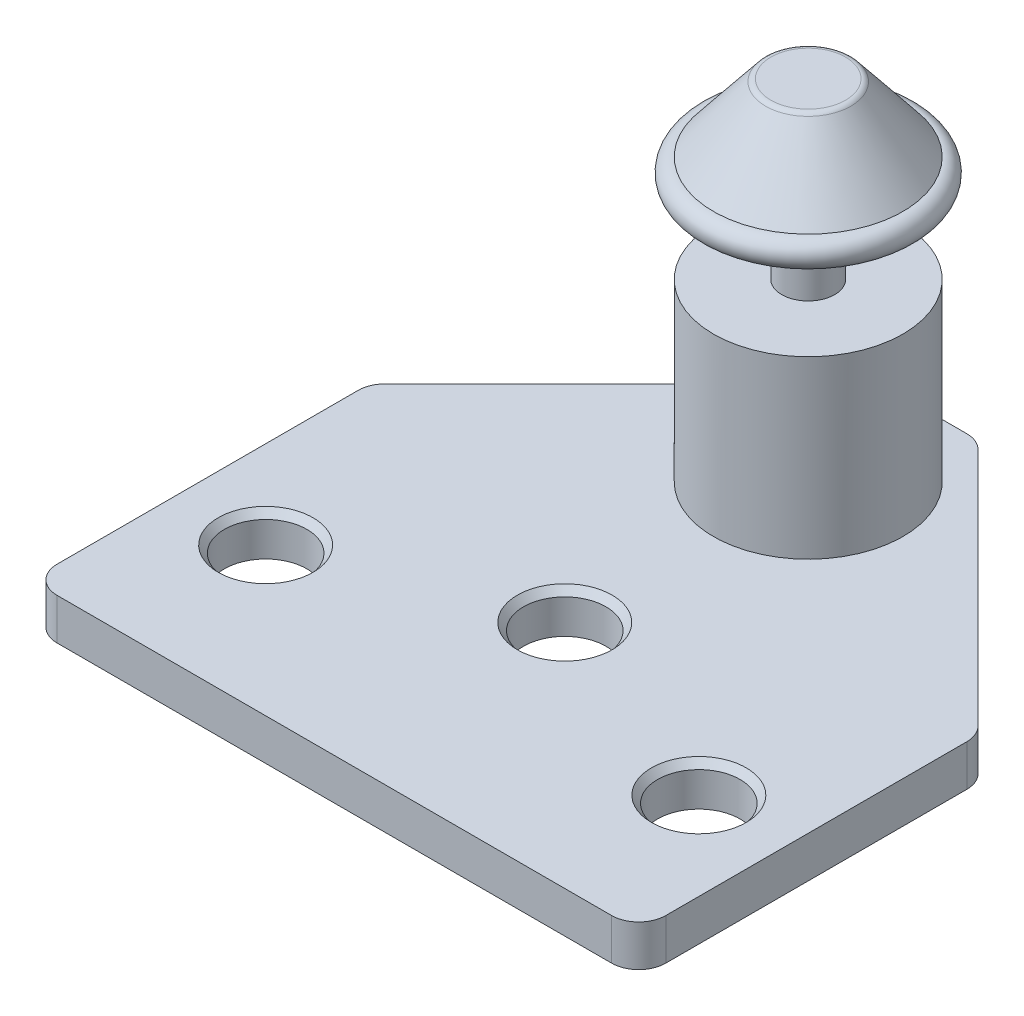
ISO-10303-21;
HEADER;
FILE_DESCRIPTION(('STEP AP214'),'2;1');
FILE_NAME('part.step','',(''),(''),'','','');
FILE_SCHEMA(('AUTOMOTIVE_DESIGN { 1 0 10303 214 1 1 1 1 }'));
ENDSEC;
DATA;
#1=APPLICATION_CONTEXT('core data for automotive mechanical design processes');
#2=APPLICATION_PROTOCOL_DEFINITION('international standard','automotive_design',2000,#1);
#3=PRODUCT_CONTEXT('',#1,'mechanical');
#4=PRODUCT('Part','Part','',(#3));
#5=PRODUCT_RELATED_PRODUCT_CATEGORY('part','',(#4));
#6=PRODUCT_DEFINITION_FORMATION('','',#4);
#7=PRODUCT_DEFINITION_CONTEXT('part definition',#1,'design');
#8=PRODUCT_DEFINITION('design','',#6,#7);
#9=PRODUCT_DEFINITION_SHAPE('','',#8);
#10=(LENGTH_UNIT() NAMED_UNIT(*) SI_UNIT(.MILLI.,.METRE.));
#11=(NAMED_UNIT(*) PLANE_ANGLE_UNIT() SI_UNIT($,.RADIAN.));
#12=(NAMED_UNIT(*) SI_UNIT($,.STERADIAN.) SOLID_ANGLE_UNIT());
#13=UNCERTAINTY_MEASURE_WITH_UNIT(LENGTH_MEASURE(1.E-05),#10,'distance_accuracy_value','');
#14=(GEOMETRIC_REPRESENTATION_CONTEXT(3) GLOBAL_UNCERTAINTY_ASSIGNED_CONTEXT((#13)) GLOBAL_UNIT_ASSIGNED_CONTEXT((#10,
#11,#12)) REPRESENTATION_CONTEXT('',''));
#15=CARTESIAN_POINT('',(0.,0.,0.));
#16=DIRECTION('',(0.,0.,1.));
#17=DIRECTION('',(1.,0.,0.));
#18=AXIS2_PLACEMENT_3D('',#15,#16,#17);
#19=CARTESIAN_POINT('',(0.,22.844,-9.93699999999994));
#20=DIRECTION('',(0.,1.,0.));
#21=DIRECTION('',(-1.,0.,0.));
#22=AXIS2_PLACEMENT_3D('',#19,#20,#21);
#23=TOROIDAL_SURFACE('',#22,7.,1.);
#24=CARTESIAN_POINT('',(0.,23.844,-9.93699999999994));
#25=DIRECTION('',(0.,1.,0.));
#26=DIRECTION('',(-1.,0.,0.));
#27=AXIS2_PLACEMENT_3D('',#24,#25,#26);
#28=CIRCLE('',#27,6.99999999999999);
#29=CARTESIAN_POINT('',(-6.99999999999999,23.844,-9.93699999999994));
#30=VERTEX_POINT('',#29);
#31=EDGE_CURVE('E299',#30,#30,#28,.T.);
#32=ORIENTED_EDGE('',*,*,#31,.F.);
#33=EDGE_LOOP('',(#32));
#34=FACE_BOUND('',#33,.T.);
#35=CARTESIAN_POINT('',(0.,21.844,-9.93699999999994));
#36=DIRECTION('',(0.,1.,0.));
#37=DIRECTION('',(-1.,0.,0.));
#38=AXIS2_PLACEMENT_3D('',#35,#36,#37);
#39=CIRCLE('',#38,7.);
#40=CARTESIAN_POINT('',(-7.,21.844,-9.93699999999994));
#41=VERTEX_POINT('',#40);
#42=EDGE_CURVE('E311',#41,#41,#39,.T.);
#43=ORIENTED_EDGE('',*,*,#42,.T.);
#44=EDGE_LOOP('',(#43));
#45=FACE_BOUND('',#44,.T.);
#46=ADVANCED_FACE('F288',(#34,#45),#23,.T.);
#47=CARTESIAN_POINT('',(0.,23.844,-9.93699999999994));
#48=DIRECTION('',(0.,-1.,0.));
#49=DIRECTION('',(1.,0.,0.));
#50=AXIS2_PLACEMENT_3D('',#47,#48,#49);
#51=CONICAL_SURFACE('',#50,6.99999999999999,0.674740942223552);
#52=CARTESIAN_POINT('',(0.,28.6563475237772,-9.93699999999994));
#53=DIRECTION('',(0.,1.,0.));
#54=DIRECTION('',(-1.,0.,0.));
#55=AXIS2_PLACEMENT_3D('',#52,#53,#54);
#56=CIRCLE('',#55,3.15012198097823);
#57=CARTESIAN_POINT('',(-3.15012198097823,28.6563475237772,-9.93699999999994));
#58=VERTEX_POINT('',#57);
#59=EDGE_CURVE('E12',#58,#58,#56,.F.);
#60=ORIENTED_EDGE('',*,*,#59,.T.);
#61=EDGE_LOOP('',(#60));
#62=FACE_BOUND('',#61,.T.);
#63=ORIENTED_EDGE('',*,*,#31,.T.);
#64=EDGE_LOOP('',(#63));
#65=FACE_BOUND('',#64,.T.);
#66=ADVANCED_FACE('F335',(#62,#65),#51,.T.);
#67=CARTESIAN_POINT('',(3.,28.844,-9.93699999999994));
#68=DIRECTION('',(0.,-1.,0.));
#69=DIRECTION('',(1.,0.,0.));
#70=AXIS2_PLACEMENT_3D('',#67,#68,#69);
#71=PLANE('',#70);
#72=CARTESIAN_POINT('',(0.,28.844,-9.93699999999994));
#73=DIRECTION('',(0.,-1.,0.));
#74=DIRECTION('',(1.,0.,0.));
#75=AXIS2_PLACEMENT_3D('',#72,#73,#74);
#76=CIRCLE('',#75,2.75968757625672);
#77=CARTESIAN_POINT('',(2.75968757625672,28.844,-9.93699999999994));
#78=VERTEX_POINT('',#77);
#79=EDGE_CURVE('E295',#78,#78,#76,.F.);
#80=ORIENTED_EDGE('',*,*,#79,.T.);
#81=EDGE_LOOP('',(#80));
#82=FACE_BOUND('',#81,.T.);
#83=ADVANCED_FACE('F330',(#82),#71,.F.);
#84=CARTESIAN_POINT('',(0.,26.494,-9.93699999999994));
#85=DIRECTION('',(0.,1.,0.));
#86=DIRECTION('',(-1.,0.,0.));
#87=AXIS2_PLACEMENT_3D('',#84,#85,#86);
#88=PLANE('',#87);
#89=CARTESIAN_POINT('',(0.,26.494,-9.93699999999994));
#90=DIRECTION('',(0.,1.,0.));
#91=DIRECTION('',(-1.,0.,0.));
#92=AXIS2_PLACEMENT_3D('',#89,#90,#91);
#93=CIRCLE('',#92,2.0558);
#94=CARTESIAN_POINT('',(-2.0558,26.494,-9.93699999999994));
#95=VERTEX_POINT('',#94);
#96=EDGE_CURVE('E303',#95,#95,#93,.T.);
#97=ORIENTED_EDGE('',*,*,#96,.F.);
#98=EDGE_LOOP('',(#97));
#99=FACE_BOUND('',#98,.T.);
#100=ADVANCED_FACE('F325',(#99),#88,.F.);
#101=CARTESIAN_POINT('',(0.,21.844,-9.93699999999994));
#102=DIRECTION('',(0.,1.,0.));
#103=DIRECTION('',(-1.,0.,0.));
#104=AXIS2_PLACEMENT_3D('',#101,#102,#103);
#105=CYLINDRICAL_SURFACE('',#104,2.0558);
#106=CARTESIAN_POINT('',(0.,21.844,-9.93699999999994));
#107=DIRECTION('',(0.,1.,0.));
#108=DIRECTION('',(-1.,0.,0.));
#109=AXIS2_PLACEMENT_3D('',#106,#107,#108);
#110=CIRCLE('',#109,2.0558);
#111=CARTESIAN_POINT('',(-2.0558,21.844,-9.93699999999994));
#112=VERTEX_POINT('',#111);
#113=EDGE_CURVE('E308',#112,#112,#110,.T.);
#114=ORIENTED_EDGE('',*,*,#113,.F.);
#115=EDGE_LOOP('',(#114));
#116=FACE_BOUND('',#115,.T.);
#117=ORIENTED_EDGE('',*,*,#96,.T.);
#118=EDGE_LOOP('',(#117));
#119=FACE_BOUND('',#118,.T.);
#120=ADVANCED_FACE('F319',(#116,#119),#105,.F.);
#121=CARTESIAN_POINT('',(2.0558,21.844,-9.93699999999994));
#122=DIRECTION('',(0.,1.,0.));
#123=DIRECTION('',(-1.,0.,0.));
#124=AXIS2_PLACEMENT_3D('',#121,#122,#123);
#125=PLANE('',#124);
#126=ORIENTED_EDGE('',*,*,#42,.F.);
#127=EDGE_LOOP('',(#126));
#128=FACE_BOUND('',#127,.T.);
#129=ORIENTED_EDGE('',*,*,#113,.T.);
#130=EDGE_LOOP('',(#129));
#131=FACE_BOUND('',#130,.T.);
#132=ADVANCED_FACE('F316',(#128,#131),#125,.F.);
#133=CARTESIAN_POINT('',(0.,28.344,-9.93699999999994));
#134=DIRECTION('',(0.,-1.,0.));
#135=DIRECTION('',(1.,0.,0.));
#136=AXIS2_PLACEMENT_3D('',#133,#134,#135);
#137=TOROIDAL_SURFACE('',#136,2.75968757625672,0.5);
#138=ORIENTED_EDGE('',*,*,#59,.F.);
#139=EDGE_LOOP('',(#138));
#140=FACE_BOUND('',#139,.T.);
#141=ORIENTED_EDGE('',*,*,#79,.F.);
#142=EDGE_LOOP('',(#141));
#143=FACE_BOUND('',#142,.T.);
#144=ADVANCED_FACE('F290',(#140,#143),#137,.T.);
#145=CLOSED_SHELL('',(#46,#66,#83,#100,#120,#132,#144));
#146=MANIFOLD_SOLID_BREP('B2',#145);
#147=CARTESIAN_POINT('',(0.,21.844,-9.93699999999994));
#148=DIRECTION('',(0.,1.,0.));
#149=DIRECTION('',(0.,0.,1.));
#150=AXIS2_PLACEMENT_3D('',#147,#148,#149);
#151=PLANE('',#150);
#152=CARTESIAN_POINT('',(0.,21.844,-9.93699999999994));
#153=DIRECTION('',(0.,1.,0.));
#154=DIRECTION('',(0.,0.,1.));
#155=AXIS2_PLACEMENT_3D('',#152,#153,#154);
#156=CIRCLE('',#155,1.9558);
#157=CARTESIAN_POINT('',(0.,21.844,-7.98119999999994));
#158=VERTEX_POINT('',#157);
#159=EDGE_CURVE('E632',#158,#158,#156,.T.);
#160=ORIENTED_EDGE('',*,*,#159,.T.);
#161=EDGE_LOOP('',(#160));
#162=FACE_BOUND('',#161,.T.);
#163=CARTESIAN_POINT('',(0.,21.844,-9.93699999999994));
#164=DIRECTION('',(0.,1.,0.));
#165=DIRECTION('',(0.,0.,1.));
#166=AXIS2_PLACEMENT_3D('',#163,#164,#165);
#167=CIRCLE('',#166,1.5);
#168=CARTESIAN_POINT('',(0.,21.844,-8.43699999999994));
#169=VERTEX_POINT('',#168);
#170=EDGE_CURVE('E639',#169,#169,#167,.T.);
#171=ORIENTED_EDGE('',*,*,#170,.F.);
#172=EDGE_LOOP('',(#171));
#173=FACE_BOUND('',#172,.T.);
#174=ADVANCED_FACE('F388',(#162,#173),#151,.T.);
#175=CARTESIAN_POINT('',(0.,16.002,-9.93699999999994));
#176=DIRECTION('',(0.,1.,0.));
#177=DIRECTION('',(0.,0.,1.));
#178=AXIS2_PLACEMENT_3D('',#175,#176,#177);
#179=PLANE('',#178);
#180=CARTESIAN_POINT('',(0.,16.002,-9.93699999999994));
#181=DIRECTION('',(0.,1.,0.));
#182=DIRECTION('',(0.,0.,1.));
#183=AXIS2_PLACEMENT_3D('',#180,#181,#182);
#184=CIRCLE('',#183,7.);
#185=CARTESIAN_POINT('',(0.,16.002,-2.93699999999994));
#186=VERTEX_POINT('',#185);
#187=EDGE_CURVE('E629',#186,#186,#184,.T.);
#188=ORIENTED_EDGE('',*,*,#187,.T.);
#189=EDGE_LOOP('',(#188));
#190=FACE_BOUND('',#189,.T.);
#191=CARTESIAN_POINT('',(0.,16.002,-9.93699999999994));
#192=DIRECTION('',(0.,1.,0.));
#193=DIRECTION('',(0.,0.,1.));
#194=AXIS2_PLACEMENT_3D('',#191,#192,#193);
#195=CIRCLE('',#194,1.9558);
#196=CARTESIAN_POINT('',(0.,16.002,-7.98119999999994));
#197=VERTEX_POINT('',#196);
#198=EDGE_CURVE('E633',#197,#197,#195,.T.);
#199=ORIENTED_EDGE('',*,*,#198,.F.);
#200=EDGE_LOOP('',(#199));
#201=FACE_BOUND('',#200,.T.);
#202=ADVANCED_FACE('F673',(#190,#201),#179,.T.);
#203=CARTESIAN_POINT('',(-22.479,3.048,25.0630000000001));
#204=DIRECTION('',(0.,-1.,0.));
#205=DIRECTION('',(0.,0.,-1.));
#206=AXIS2_PLACEMENT_3D('',#203,#204,#205);
#207=PLANE('',#206);
#208=DIRECTION('',(-0.707106781186549,0.,-0.707106781186546));
#209=VECTOR('',#208,1.);
#210=CARTESIAN_POINT('',(3.6,3.048,-18.8789999999999));
#211=LINE('',#210,#209);
#212=CARTESIAN_POINT('',(21.8932135623731,3.048,-0.585786437626905));
#213=VERTEX_POINT('',#212);
#214=CARTESIAN_POINT('',(4.1857864376269,3.048,-18.293213562373));
#215=VERTEX_POINT('',#214);
#216=EDGE_CURVE('E594',#213,#215,#211,.T.);
#217=ORIENTED_EDGE('',*,*,#216,.T.);
#218=CARTESIAN_POINT('',(2.77157287525381,3.048,-16.8789999999999));
#219=DIRECTION('',(0.,-1.,0.));
#220=DIRECTION('',(0.,0.,-1.));
#221=AXIS2_PLACEMENT_3D('',#218,#219,#220);
#222=CIRCLE('',#221,2.);
#223=CARTESIAN_POINT('',(2.77157287525381,3.048,-18.8789999999999));
#224=VERTEX_POINT('',#223);
#225=EDGE_CURVE('E541',#215,#224,#222,.F.);
#226=ORIENTED_EDGE('',*,*,#225,.T.);
#227=DIRECTION('',(-1.,0.,0.));
#228=VECTOR('',#227,1.);
#229=CARTESIAN_POINT('',(-3.6,3.048,-18.8789999999999));
#230=LINE('',#229,#228);
#231=CARTESIAN_POINT('',(-2.77157287525381,3.048,-18.8789999999999));
#232=VERTEX_POINT('',#231);
#233=EDGE_CURVE('E498',#224,#232,#230,.T.);
#234=ORIENTED_EDGE('',*,*,#233,.T.);
#235=CARTESIAN_POINT('',(-2.77157287525381,3.048,-16.8789999999999));
#236=DIRECTION('',(0.,-1.,0.));
#237=DIRECTION('',(0.,0.,-1.));
#238=AXIS2_PLACEMENT_3D('',#235,#236,#237);
#239=CIRCLE('',#238,2.);
#240=CARTESIAN_POINT('',(-4.1857864376269,3.048,-18.293213562373));
#241=VERTEX_POINT('',#240);
#242=EDGE_CURVE('E532',#232,#241,#239,.F.);
#243=ORIENTED_EDGE('',*,*,#242,.T.);
#244=DIRECTION('',(-0.707106781186549,0.,0.707106781186546));
#245=VECTOR('',#244,1.);
#246=CARTESIAN_POINT('',(-22.479,3.048,0.));
#247=LINE('',#246,#245);
#248=CARTESIAN_POINT('',(-21.8932135623731,3.048,-0.585786437626901));
#249=VERTEX_POINT('',#248);
#250=EDGE_CURVE('E562',#241,#249,#247,.T.);
#251=ORIENTED_EDGE('',*,*,#250,.T.);
#252=CARTESIAN_POINT('',(-20.479,3.048,0.828427124746199));
#253=DIRECTION('',(0.,-1.,0.));
#254=DIRECTION('',(0.,0.,-1.));
#255=AXIS2_PLACEMENT_3D('',#252,#253,#254);
#256=CIRCLE('',#255,2.);
#257=CARTESIAN_POINT('',(-22.479,3.048,0.828427124746199));
#258=VERTEX_POINT('',#257);
#259=EDGE_CURVE('E410',#249,#258,#256,.F.);
#260=ORIENTED_EDGE('',*,*,#259,.T.);
#261=DIRECTION('',(0.,0.,1.));
#262=VECTOR('',#261,1.);
#263=CARTESIAN_POINT('',(-22.479,3.048,25.0630000000001));
#264=LINE('',#263,#262);
#265=CARTESIAN_POINT('',(-22.479,3.048,23.0630000000001));
#266=VERTEX_POINT('',#265);
#267=EDGE_CURVE('E519',#258,#266,#264,.T.);
#268=ORIENTED_EDGE('',*,*,#267,.T.);
#269=CARTESIAN_POINT('',(-20.479,3.048,23.0630000000001));
#270=DIRECTION('',(0.,-1.,0.));
#271=DIRECTION('',(0.,0.,-1.));
#272=AXIS2_PLACEMENT_3D('',#269,#270,#271);
#273=CIRCLE('',#272,2.);
#274=CARTESIAN_POINT('',(-20.479,3.048,25.0630000000001));
#275=VERTEX_POINT('',#274);
#276=EDGE_CURVE('E535',#266,#275,#273,.F.);
#277=ORIENTED_EDGE('',*,*,#276,.T.);
#278=DIRECTION('',(1.,0.,0.));
#279=VECTOR('',#278,1.);
#280=CARTESIAN_POINT('',(22.479,3.048,25.0630000000001));
#281=LINE('',#280,#279);
#282=CARTESIAN_POINT('',(20.479,3.048,25.0630000000001));
#283=VERTEX_POINT('',#282);
#284=EDGE_CURVE('E515',#275,#283,#281,.T.);
#285=ORIENTED_EDGE('',*,*,#284,.T.);
#286=CARTESIAN_POINT('',(20.479,3.048,23.0630000000001));
#287=DIRECTION('',(0.,-1.,0.));
#288=DIRECTION('',(0.,0.,-1.));
#289=AXIS2_PLACEMENT_3D('',#286,#287,#288);
#290=CIRCLE('',#289,2.);
#291=CARTESIAN_POINT('',(22.479,3.048,23.0630000000001));
#292=VERTEX_POINT('',#291);
#293=EDGE_CURVE('E537',#283,#292,#290,.F.);
#294=ORIENTED_EDGE('',*,*,#293,.T.);
#295=DIRECTION('',(0.,0.,-1.));
#296=VECTOR('',#295,1.);
#297=CARTESIAN_POINT('',(22.479,3.048,0.));
#298=LINE('',#297,#296);
#299=CARTESIAN_POINT('',(22.479,3.048,0.828427124746192));
#300=VERTEX_POINT('',#299);
#301=EDGE_CURVE('E595',#292,#300,#298,.T.);
#302=ORIENTED_EDGE('',*,*,#301,.T.);
#303=CARTESIAN_POINT('',(20.479,3.048,0.828427124746192));
#304=DIRECTION('',(0.,-1.,0.));
#305=DIRECTION('',(0.,0.,-1.));
#306=AXIS2_PLACEMENT_3D('',#303,#304,#305);
#307=CIRCLE('',#306,2.);
#308=EDGE_CURVE('E539',#300,#213,#307,.F.);
#309=ORIENTED_EDGE('',*,*,#308,.T.);
#310=EDGE_LOOP('',(#217,#226,#234,#243,#251,#260,#268,#277,#285,#294,#302,#309));
#311=FACE_BOUND('',#310,.T.);
#312=CARTESIAN_POINT('',(-16.,3.048,14.1410000000001));
#313=DIRECTION('',(0.,1.,0.));
#314=DIRECTION('',(0.,0.,1.));
#315=AXIS2_PLACEMENT_3D('',#312,#313,#314);
#316=CIRCLE('',#315,3.5);
#317=CARTESIAN_POINT('',(-16.,3.048,17.6410000000001));
#318=VERTEX_POINT('',#317);
#319=EDGE_CURVE('E608',#318,#318,#316,.T.);
#320=ORIENTED_EDGE('',*,*,#319,.F.);
#321=EDGE_LOOP('',(#320));
#322=FACE_BOUND('',#321,.T.);
#323=CARTESIAN_POINT('',(16.,3.048,14.1410000000001));
#324=DIRECTION('',(0.,1.,0.));
#325=DIRECTION('',(0.,0.,1.));
#326=AXIS2_PLACEMENT_3D('',#323,#324,#325);
#327=CIRCLE('',#326,3.5);
#328=CARTESIAN_POINT('',(16.,3.048,17.6410000000001));
#329=VERTEX_POINT('',#328);
#330=EDGE_CURVE('E617',#329,#329,#327,.T.);
#331=ORIENTED_EDGE('',*,*,#330,.F.);
#332=EDGE_LOOP('',(#331));
#333=FACE_BOUND('',#332,.T.);
#334=CARTESIAN_POINT('',(0.,3.048,8.04500000000007));
#335=DIRECTION('',(0.,1.,0.));
#336=DIRECTION('',(0.,0.,1.));
#337=AXIS2_PLACEMENT_3D('',#334,#335,#336);
#338=CIRCLE('',#337,3.5);
#339=CARTESIAN_POINT('',(0.,3.048,11.5450000000001));
#340=VERTEX_POINT('',#339);
#341=EDGE_CURVE('E626',#340,#340,#338,.T.);
#342=ORIENTED_EDGE('',*,*,#341,.F.);
#343=EDGE_LOOP('',(#342));
#344=FACE_BOUND('',#343,.T.);
#345=CARTESIAN_POINT('',(0.,3.048,-9.93699999999994));
#346=DIRECTION('',(0.,-1.,0.));
#347=DIRECTION('',(0.,0.,-1.));
#348=AXIS2_PLACEMENT_3D('',#345,#346,#347);
#349=CIRCLE('',#348,7.);
#350=CARTESIAN_POINT('',(0.,3.048,-16.9369999999999));
#351=VERTEX_POINT('',#350);
#352=EDGE_CURVE('E516',#351,#351,#349,.F.);
#353=ORIENTED_EDGE('',*,*,#352,.F.);
#354=EDGE_LOOP('',(#353));
#355=FACE_BOUND('',#354,.T.);
#356=ADVANCED_FACE('F592',(#311,#322,#333,#344,#355),#207,.F.);
#357=CARTESIAN_POINT('',(22.479,3.048,25.0630000000001));
#358=DIRECTION('',(0.,0.,-1.));
#359=DIRECTION('',(-1.,0.,0.));
#360=AXIS2_PLACEMENT_3D('',#357,#358,#359);
#361=PLANE('',#360);
#362=DIRECTION('',(1.,0.,0.));
#363=VECTOR('',#362,1.);
#364=CARTESIAN_POINT('',(22.479,0.,25.0630000000001));
#365=LINE('',#364,#363);
#366=CARTESIAN_POINT('',(-20.479,0.,25.0630000000001));
#367=VERTEX_POINT('',#366);
#368=CARTESIAN_POINT('',(20.479,0.,25.0630000000001));
#369=VERTEX_POINT('',#368);
#370=EDGE_CURVE('E575',#367,#369,#365,.T.);
#371=ORIENTED_EDGE('',*,*,#370,.T.);
#372=DIRECTION('',(0.,-1.,0.));
#373=VECTOR('',#372,1.);
#374=CARTESIAN_POINT('',(20.479,3.048,25.0630000000001));
#375=LINE('',#374,#373);
#376=EDGE_CURVE('E551',#369,#283,#375,.F.);
#377=ORIENTED_EDGE('',*,*,#376,.T.);
#378=ORIENTED_EDGE('',*,*,#284,.F.);
#379=DIRECTION('',(0.,-1.,0.));
#380=VECTOR('',#379,1.);
#381=CARTESIAN_POINT('',(-20.479,3.048,25.0630000000001));
#382=LINE('',#381,#380);
#383=EDGE_CURVE('E548',#275,#367,#382,.T.);
#384=ORIENTED_EDGE('',*,*,#383,.T.);
#385=EDGE_LOOP('',(#371,#377,#378,#384));
#386=FACE_BOUND('',#385,.T.);
#387=ADVANCED_FACE('F715',(#386),#361,.F.);
#388=CARTESIAN_POINT('',(22.479,3.048,0.));
#389=DIRECTION('',(-1.,0.,0.));
#390=DIRECTION('',(0.,0.,1.));
#391=AXIS2_PLACEMENT_3D('',#388,#389,#390);
#392=PLANE('',#391);
#393=DIRECTION('',(0.,0.,-1.));
#394=VECTOR('',#393,1.);
#395=CARTESIAN_POINT('',(22.479,0.,0.));
#396=LINE('',#395,#394);
#397=CARTESIAN_POINT('',(22.479,0.,23.0630000000001));
#398=VERTEX_POINT('',#397);
#399=CARTESIAN_POINT('',(22.479,0.,0.828427124746192));
#400=VERTEX_POINT('',#399);
#401=EDGE_CURVE('E510',#398,#400,#396,.T.);
#402=ORIENTED_EDGE('',*,*,#401,.T.);
#403=DIRECTION('',(0.,-1.,0.));
#404=VECTOR('',#403,1.);
#405=CARTESIAN_POINT('',(22.479,3.048,0.828427124746192));
#406=LINE('',#405,#404);
#407=EDGE_CURVE('E546',#400,#300,#406,.F.);
#408=ORIENTED_EDGE('',*,*,#407,.T.);
#409=ORIENTED_EDGE('',*,*,#301,.F.);
#410=DIRECTION('',(0.,-1.,0.));
#411=VECTOR('',#410,1.);
#412=CARTESIAN_POINT('',(22.479,3.048,23.0630000000001));
#413=LINE('',#412,#411);
#414=EDGE_CURVE('E543',#292,#398,#413,.T.);
#415=ORIENTED_EDGE('',*,*,#414,.T.);
#416=EDGE_LOOP('',(#402,#408,#409,#415));
#417=FACE_BOUND('',#416,.T.);
#418=ADVANCED_FACE('F582',(#417),#392,.F.);
#419=CARTESIAN_POINT('',(3.6,3.048,-18.8789999999999));
#420=DIRECTION('',(-0.707106781186546,0.,0.707106781186549));
#421=DIRECTION('',(0.707106781186549,0.,0.707106781186546));
#422=AXIS2_PLACEMENT_3D('',#419,#420,#421);
#423=PLANE('',#422);
#424=DIRECTION('',(-0.707106781186549,0.,-0.707106781186546));
#425=VECTOR('',#424,1.);
#426=CARTESIAN_POINT('',(3.6,0.,-18.8789999999999));
#427=LINE('',#426,#425);
#428=CARTESIAN_POINT('',(21.8932135623731,0.,-0.585786437626905));
#429=VERTEX_POINT('',#428);
#430=CARTESIAN_POINT('',(4.1857864376269,0.,-18.293213562373));
#431=VERTEX_POINT('',#430);
#432=EDGE_CURVE('E505',#429,#431,#427,.T.);
#433=ORIENTED_EDGE('',*,*,#432,.T.);
#434=DIRECTION('',(0.,-1.,0.));
#435=VECTOR('',#434,1.);
#436=CARTESIAN_POINT('',(4.1857864376269,3.048,-18.293213562373));
#437=LINE('',#436,#435);
#438=EDGE_CURVE('E483',#431,#215,#437,.F.);
#439=ORIENTED_EDGE('',*,*,#438,.T.);
#440=ORIENTED_EDGE('',*,*,#216,.F.);
#441=DIRECTION('',(0.,-1.,0.));
#442=VECTOR('',#441,1.);
#443=CARTESIAN_POINT('',(21.8932135623731,3.048,-0.585786437626905));
#444=LINE('',#443,#442);
#445=EDGE_CURVE('E488',#213,#429,#444,.T.);
#446=ORIENTED_EDGE('',*,*,#445,.T.);
#447=EDGE_LOOP('',(#433,#439,#440,#446));
#448=FACE_BOUND('',#447,.T.);
#449=ADVANCED_FACE('F597',(#448),#423,.F.);
#450=CARTESIAN_POINT('',(-3.6,3.048,-18.8789999999999));
#451=DIRECTION('',(0.,0.,1.));
#452=DIRECTION('',(1.,0.,0.));
#453=AXIS2_PLACEMENT_3D('',#450,#451,#452);
#454=PLANE('',#453);
#455=ORIENTED_EDGE('',*,*,#233,.F.);
#456=DIRECTION('',(0.,-1.,0.));
#457=VECTOR('',#456,1.);
#458=CARTESIAN_POINT('',(2.77157287525381,3.048,-18.8789999999999));
#459=LINE('',#458,#457);
#460=CARTESIAN_POINT('',(2.77157287525381,0.,-18.8789999999999));
#461=VERTEX_POINT('',#460);
#462=EDGE_CURVE('E482',#224,#461,#459,.T.);
#463=ORIENTED_EDGE('',*,*,#462,.T.);
#464=DIRECTION('',(-1.,0.,0.));
#465=VECTOR('',#464,1.);
#466=CARTESIAN_POINT('',(-3.6,0.,-18.8789999999999));
#467=LINE('',#466,#465);
#468=CARTESIAN_POINT('',(-2.77157287525381,0.,-18.8789999999999));
#469=VERTEX_POINT('',#468);
#470=EDGE_CURVE('E495',#461,#469,#467,.T.);
#471=ORIENTED_EDGE('',*,*,#470,.T.);
#472=DIRECTION('',(0.,-1.,0.));
#473=VECTOR('',#472,1.);
#474=CARTESIAN_POINT('',(-2.77157287525381,3.048,-18.8789999999999));
#475=LINE('',#474,#473);
#476=EDGE_CURVE('E500',#469,#232,#475,.F.);
#477=ORIENTED_EDGE('',*,*,#476,.T.);
#478=EDGE_LOOP('',(#455,#463,#471,#477));
#479=FACE_BOUND('',#478,.T.);
#480=ADVANCED_FACE('F494',(#479),#454,.F.);
#481=CARTESIAN_POINT('',(-22.479,3.048,0.));
#482=DIRECTION('',(0.707106781186546,0.,0.707106781186549));
#483=DIRECTION('',(0.707106781186549,0.,-0.707106781186546));
#484=AXIS2_PLACEMENT_3D('',#481,#482,#483);
#485=PLANE('',#484);
#486=DIRECTION('',(-0.707106781186549,0.,0.707106781186546));
#487=VECTOR('',#486,1.);
#488=CARTESIAN_POINT('',(-22.479,0.,0.));
#489=LINE('',#488,#487);
#490=CARTESIAN_POINT('',(-4.1857864376269,0.,-18.293213562373));
#491=VERTEX_POINT('',#490);
#492=CARTESIAN_POINT('',(-21.8932135623731,0.,-0.585786437626901));
#493=VERTEX_POINT('',#492);
#494=EDGE_CURVE('E504',#491,#493,#489,.T.);
#495=ORIENTED_EDGE('',*,*,#494,.T.);
#496=DIRECTION('',(0.,-1.,0.));
#497=VECTOR('',#496,1.);
#498=CARTESIAN_POINT('',(-21.8932135623731,3.048,-0.585786437626901));
#499=LINE('',#498,#497);
#500=EDGE_CURVE('E286',#493,#249,#499,.F.);
#501=ORIENTED_EDGE('',*,*,#500,.T.);
#502=ORIENTED_EDGE('',*,*,#250,.F.);
#503=DIRECTION('',(0.,-1.,0.));
#504=VECTOR('',#503,1.);
#505=CARTESIAN_POINT('',(-4.1857864376269,3.048,-18.293213562373));
#506=LINE('',#505,#504);
#507=EDGE_CURVE('E396',#241,#491,#506,.T.);
#508=ORIENTED_EDGE('',*,*,#507,.T.);
#509=EDGE_LOOP('',(#495,#501,#502,#508));
#510=FACE_BOUND('',#509,.T.);
#511=ADVANCED_FACE('F560',(#510),#485,.F.);
#512=CARTESIAN_POINT('',(-22.479,3.048,25.0630000000001));
#513=DIRECTION('',(1.,0.,0.));
#514=DIRECTION('',(0.,0.,-1.));
#515=AXIS2_PLACEMENT_3D('',#512,#513,#514);
#516=PLANE('',#515);
#517=DIRECTION('',(0.,0.,1.));
#518=VECTOR('',#517,1.);
#519=CARTESIAN_POINT('',(-22.479,0.,25.0630000000001));
#520=LINE('',#519,#518);
#521=CARTESIAN_POINT('',(-22.479,0.,0.828427124746199));
#522=VERTEX_POINT('',#521);
#523=CARTESIAN_POINT('',(-22.479,0.,23.0630000000001));
#524=VERTEX_POINT('',#523);
#525=EDGE_CURVE('E508',#522,#524,#520,.T.);
#526=ORIENTED_EDGE('',*,*,#525,.T.);
#527=DIRECTION('',(0.,-1.,0.));
#528=VECTOR('',#527,1.);
#529=CARTESIAN_POINT('',(-22.479,3.048,23.0630000000001));
#530=LINE('',#529,#528);
#531=EDGE_CURVE('E403',#524,#266,#530,.F.);
#532=ORIENTED_EDGE('',*,*,#531,.T.);
#533=ORIENTED_EDGE('',*,*,#267,.F.);
#534=DIRECTION('',(0.,-1.,0.));
#535=VECTOR('',#534,1.);
#536=CARTESIAN_POINT('',(-22.479,3.048,0.828427124746199));
#537=LINE('',#536,#535);
#538=EDGE_CURVE('E553',#258,#522,#537,.T.);
#539=ORIENTED_EDGE('',*,*,#538,.T.);
#540=EDGE_LOOP('',(#526,#532,#533,#539));
#541=FACE_BOUND('',#540,.T.);
#542=ADVANCED_FACE('F569',(#541),#516,.F.);
#543=CARTESIAN_POINT('',(-22.479,0.,25.0630000000001));
#544=DIRECTION('',(0.,-1.,0.));
#545=DIRECTION('',(0.,0.,-1.));
#546=AXIS2_PLACEMENT_3D('',#543,#544,#545);
#547=PLANE('',#546);
#548=CARTESIAN_POINT('',(0.,0.,8.04500000000007));
#549=DIRECTION('',(0.,1.,0.));
#550=DIRECTION('',(0.,0.,1.));
#551=AXIS2_PLACEMENT_3D('',#548,#549,#550);
#552=CIRCLE('',#551,3.048);
#553=CARTESIAN_POINT('',(0.,0.,11.0930000000001));
#554=VERTEX_POINT('',#553);
#555=EDGE_CURVE('E620',#554,#554,#552,.T.);
#556=ORIENTED_EDGE('',*,*,#555,.T.);
#557=EDGE_LOOP('',(#556));
#558=FACE_BOUND('',#557,.T.);
#559=CARTESIAN_POINT('',(16.,0.,14.1410000000001));
#560=DIRECTION('',(0.,1.,0.));
#561=DIRECTION('',(0.,0.,1.));
#562=AXIS2_PLACEMENT_3D('',#559,#560,#561);
#563=CIRCLE('',#562,3.048);
#564=CARTESIAN_POINT('',(16.,0.,17.1890000000001));
#565=VERTEX_POINT('',#564);
#566=EDGE_CURVE('E611',#565,#565,#563,.T.);
#567=ORIENTED_EDGE('',*,*,#566,.T.);
#568=EDGE_LOOP('',(#567));
#569=FACE_BOUND('',#568,.T.);
#570=CARTESIAN_POINT('',(-16.,0.,14.1410000000001));
#571=DIRECTION('',(0.,1.,0.));
#572=DIRECTION('',(0.,0.,1.));
#573=AXIS2_PLACEMENT_3D('',#570,#571,#572);
#574=CIRCLE('',#573,3.048);
#575=CARTESIAN_POINT('',(-16.,0.,17.1890000000001));
#576=VERTEX_POINT('',#575);
#577=EDGE_CURVE('E577',#576,#576,#574,.T.);
#578=ORIENTED_EDGE('',*,*,#577,.T.);
#579=EDGE_LOOP('',(#578));
#580=FACE_BOUND('',#579,.T.);
#581=ORIENTED_EDGE('',*,*,#470,.F.);
#582=CARTESIAN_POINT('',(2.77157287525381,0.,-16.8789999999999));
#583=DIRECTION('',(0.,-1.,0.));
#584=DIRECTION('',(0.,0.,-1.));
#585=AXIS2_PLACEMENT_3D('',#582,#583,#584);
#586=CIRCLE('',#585,2.);
#587=EDGE_CURVE('E478',#461,#431,#586,.T.);
#588=ORIENTED_EDGE('',*,*,#587,.T.);
#589=ORIENTED_EDGE('',*,*,#432,.F.);
#590=CARTESIAN_POINT('',(20.479,0.,0.828427124746192));
#591=DIRECTION('',(0.,-1.,0.));
#592=DIRECTION('',(0.,0.,-1.));
#593=AXIS2_PLACEMENT_3D('',#590,#591,#592);
#594=CIRCLE('',#593,2.);
#595=EDGE_CURVE('E489',#429,#400,#594,.T.);
#596=ORIENTED_EDGE('',*,*,#595,.T.);
#597=ORIENTED_EDGE('',*,*,#401,.F.);
#598=CARTESIAN_POINT('',(20.479,0.,23.0630000000001));
#599=DIRECTION('',(0.,-1.,0.));
#600=DIRECTION('',(0.,0.,-1.));
#601=AXIS2_PLACEMENT_3D('',#598,#599,#600);
#602=CIRCLE('',#601,2.);
#603=EDGE_CURVE('E526',#398,#369,#602,.T.);
#604=ORIENTED_EDGE('',*,*,#603,.T.);
#605=ORIENTED_EDGE('',*,*,#370,.F.);
#606=CARTESIAN_POINT('',(-20.479,0.,23.0630000000001));
#607=DIRECTION('',(0.,-1.,0.));
#608=DIRECTION('',(0.,0.,-1.));
#609=AXIS2_PLACEMENT_3D('',#606,#607,#608);
#610=CIRCLE('',#609,2.);
#611=EDGE_CURVE('E524',#367,#524,#610,.T.);
#612=ORIENTED_EDGE('',*,*,#611,.T.);
#613=ORIENTED_EDGE('',*,*,#525,.F.);
#614=CARTESIAN_POINT('',(-20.479,0.,0.828427124746199));
#615=DIRECTION('',(0.,-1.,0.));
#616=DIRECTION('',(0.,0.,-1.));
#617=AXIS2_PLACEMENT_3D('',#614,#615,#616);
#618=CIRCLE('',#617,2.);
#619=EDGE_CURVE('E522',#522,#493,#618,.T.);
#620=ORIENTED_EDGE('',*,*,#619,.T.);
#621=ORIENTED_EDGE('',*,*,#494,.F.);
#622=CARTESIAN_POINT('',(-2.77157287525381,0.,-16.8789999999999));
#623=DIRECTION('',(0.,-1.,0.));
#624=DIRECTION('',(0.,0.,-1.));
#625=AXIS2_PLACEMENT_3D('',#622,#623,#624);
#626=CIRCLE('',#625,2.);
#627=EDGE_CURVE('E499',#491,#469,#626,.T.);
#628=ORIENTED_EDGE('',*,*,#627,.T.);
#629=EDGE_LOOP('',(#581,#588,#589,#596,#597,#604,#605,#612,#613,#620,#621,#628));
#630=FACE_BOUND('',#629,.T.);
#631=ADVANCED_FACE('F502',(#558,#569,#580,#630),#547,.T.);
#632=CARTESIAN_POINT('',(-16.,3.048,14.1410000000001));
#633=DIRECTION('',(0.,1.,0.));
#634=DIRECTION('',(0.,0.,1.));
#635=AXIS2_PLACEMENT_3D('',#632,#633,#634);
#636=CYLINDRICAL_SURFACE('',#635,3.048);
#637=ORIENTED_EDGE('',*,*,#577,.F.);
#638=EDGE_LOOP('',(#637));
#639=FACE_BOUND('',#638,.T.);
#640=CARTESIAN_POINT('',(-16.,2.52803347993611,14.1410000000001));
#641=DIRECTION('',(0.,1.,0.));
#642=DIRECTION('',(0.,0.,1.));
#643=AXIS2_PLACEMENT_3D('',#640,#641,#642);
#644=CIRCLE('',#643,3.048);
#645=CARTESIAN_POINT('',(-16.,2.52803347993611,17.1890000000001));
#646=VERTEX_POINT('',#645);
#647=EDGE_CURVE('E605',#646,#646,#644,.T.);
#648=ORIENTED_EDGE('',*,*,#647,.T.);
#649=EDGE_LOOP('',(#648));
#650=FACE_BOUND('',#649,.T.);
#651=ADVANCED_FACE('F708',(#639,#650),#636,.F.);
#652=CARTESIAN_POINT('',(-16.,3.048,14.1410000000001));
#653=DIRECTION('',(0.,1.,0.));
#654=DIRECTION('',(0.,0.,1.));
#655=AXIS2_PLACEMENT_3D('',#652,#653,#654);
#656=CONICAL_SURFACE('',#655,3.5,0.715584993317677);
#657=ORIENTED_EDGE('',*,*,#647,.F.);
#658=EDGE_LOOP('',(#657));
#659=FACE_BOUND('',#658,.T.);
#660=ORIENTED_EDGE('',*,*,#319,.T.);
#661=EDGE_LOOP('',(#660));
#662=FACE_BOUND('',#661,.T.);
#663=ADVANCED_FACE('F704',(#659,#662),#656,.F.);
#664=CARTESIAN_POINT('',(16.,3.048,14.1410000000001));
#665=DIRECTION('',(0.,1.,0.));
#666=DIRECTION('',(0.,0.,1.));
#667=AXIS2_PLACEMENT_3D('',#664,#665,#666);
#668=CYLINDRICAL_SURFACE('',#667,3.048);
#669=ORIENTED_EDGE('',*,*,#566,.F.);
#670=EDGE_LOOP('',(#669));
#671=FACE_BOUND('',#670,.T.);
#672=CARTESIAN_POINT('',(16.,2.52803347993611,14.1410000000001));
#673=DIRECTION('',(0.,1.,0.));
#674=DIRECTION('',(0.,0.,1.));
#675=AXIS2_PLACEMENT_3D('',#672,#673,#674);
#676=CIRCLE('',#675,3.048);
#677=CARTESIAN_POINT('',(16.,2.52803347993611,17.1890000000001));
#678=VERTEX_POINT('',#677);
#679=EDGE_CURVE('E614',#678,#678,#676,.T.);
#680=ORIENTED_EDGE('',*,*,#679,.T.);
#681=EDGE_LOOP('',(#680));
#682=FACE_BOUND('',#681,.T.);
#683=ADVANCED_FACE('F700',(#671,#682),#668,.F.);
#684=CARTESIAN_POINT('',(16.,3.048,14.1410000000001));
#685=DIRECTION('',(0.,1.,0.));
#686=DIRECTION('',(0.,0.,1.));
#687=AXIS2_PLACEMENT_3D('',#684,#685,#686);
#688=CONICAL_SURFACE('',#687,3.5,0.715584993317675);
#689=ORIENTED_EDGE('',*,*,#679,.F.);
#690=EDGE_LOOP('',(#689));
#691=FACE_BOUND('',#690,.T.);
#692=ORIENTED_EDGE('',*,*,#330,.T.);
#693=EDGE_LOOP('',(#692));
#694=FACE_BOUND('',#693,.T.);
#695=ADVANCED_FACE('F696',(#691,#694),#688,.F.);
#696=CARTESIAN_POINT('',(0.,3.048,8.04500000000007));
#697=DIRECTION('',(0.,1.,0.));
#698=DIRECTION('',(0.,0.,1.));
#699=AXIS2_PLACEMENT_3D('',#696,#697,#698);
#700=CYLINDRICAL_SURFACE('',#699,3.048);
#701=ORIENTED_EDGE('',*,*,#555,.F.);
#702=EDGE_LOOP('',(#701));
#703=FACE_BOUND('',#702,.T.);
#704=CARTESIAN_POINT('',(0.,2.52803347993611,8.04500000000007));
#705=DIRECTION('',(0.,1.,0.));
#706=DIRECTION('',(0.,0.,1.));
#707=AXIS2_PLACEMENT_3D('',#704,#705,#706);
#708=CIRCLE('',#707,3.048);
#709=CARTESIAN_POINT('',(0.,2.52803347993611,11.0930000000001));
#710=VERTEX_POINT('',#709);
#711=EDGE_CURVE('E623',#710,#710,#708,.T.);
#712=ORIENTED_EDGE('',*,*,#711,.T.);
#713=EDGE_LOOP('',(#712));
#714=FACE_BOUND('',#713,.T.);
#715=ADVANCED_FACE('F692',(#703,#714),#700,.F.);
#716=CARTESIAN_POINT('',(0.,3.048,8.04500000000007));
#717=DIRECTION('',(0.,1.,0.));
#718=DIRECTION('',(0.,0.,1.));
#719=AXIS2_PLACEMENT_3D('',#716,#717,#718);
#720=CONICAL_SURFACE('',#719,3.5,0.715584993317677);
#721=ORIENTED_EDGE('',*,*,#711,.F.);
#722=EDGE_LOOP('',(#721));
#723=FACE_BOUND('',#722,.T.);
#724=ORIENTED_EDGE('',*,*,#341,.T.);
#725=EDGE_LOOP('',(#724));
#726=FACE_BOUND('',#725,.T.);
#727=ADVANCED_FACE('F688',(#723,#726),#720,.F.);
#728=CARTESIAN_POINT('',(0.,16.002,-9.93699999999994));
#729=DIRECTION('',(0.,-1.,0.));
#730=DIRECTION('',(0.,0.,-1.));
#731=AXIS2_PLACEMENT_3D('',#728,#729,#730);
#732=CYLINDRICAL_SURFACE('',#731,7.);
#733=ORIENTED_EDGE('',*,*,#187,.F.);
#734=EDGE_LOOP('',(#733));
#735=FACE_BOUND('',#734,.T.);
#736=ORIENTED_EDGE('',*,*,#352,.T.);
#737=EDGE_LOOP('',(#736));
#738=FACE_BOUND('',#737,.T.);
#739=ADVANCED_FACE('F683',(#735,#738),#732,.T.);
#740=CARTESIAN_POINT('',(0.,21.844,-9.93699999999994));
#741=DIRECTION('',(0.,-1.,0.));
#742=DIRECTION('',(0.,0.,-1.));
#743=AXIS2_PLACEMENT_3D('',#740,#741,#742);
#744=CYLINDRICAL_SURFACE('',#743,1.9558);
#745=ORIENTED_EDGE('',*,*,#159,.F.);
#746=EDGE_LOOP('',(#745));
#747=FACE_BOUND('',#746,.T.);
#748=ORIENTED_EDGE('',*,*,#198,.T.);
#749=EDGE_LOOP('',(#748));
#750=FACE_BOUND('',#749,.T.);
#751=ADVANCED_FACE('F668',(#747,#750),#744,.T.);
#752=CARTESIAN_POINT('',(0.,23.244,-9.93699999999994));
#753=DIRECTION('',(0.,-1.,0.));
#754=DIRECTION('',(0.,0.,-1.));
#755=AXIS2_PLACEMENT_3D('',#752,#753,#754);
#756=CYLINDRICAL_SURFACE('',#755,1.5);
#757=CARTESIAN_POINT('',(0.,23.244,-9.93699999999994));
#758=DIRECTION('',(0.,1.,0.));
#759=DIRECTION('',(0.,0.,1.));
#760=AXIS2_PLACEMENT_3D('',#757,#758,#759);
#761=CIRCLE('',#760,1.5);
#762=CARTESIAN_POINT('',(0.,23.244,-8.43699999999994));
#763=VERTEX_POINT('',#762);
#764=EDGE_CURVE('E636',#763,#763,#761,.T.);
#765=ORIENTED_EDGE('',*,*,#764,.F.);
#766=EDGE_LOOP('',(#765));
#767=FACE_BOUND('',#766,.T.);
#768=ORIENTED_EDGE('',*,*,#170,.T.);
#769=EDGE_LOOP('',(#768));
#770=FACE_BOUND('',#769,.T.);
#771=ADVANCED_FACE('F662',(#767,#770),#756,.T.);
#772=CARTESIAN_POINT('',(0.,23.244,-9.93699999999994));
#773=DIRECTION('',(0.,1.,0.));
#774=DIRECTION('',(0.,0.,1.));
#775=AXIS2_PLACEMENT_3D('',#772,#773,#774);
#776=PLANE('',#775);
#777=CARTESIAN_POINT('',(0.,23.244,-9.93699999999994));
#778=DIRECTION('',(0.,1.,0.));
#779=DIRECTION('',(0.,0.,1.));
#780=AXIS2_PLACEMENT_3D('',#777,#778,#779);
#781=CIRCLE('',#780,1.9558);
#782=CARTESIAN_POINT('',(0.,23.244,-7.98119999999994));
#783=VERTEX_POINT('',#782);
#784=EDGE_CURVE('E645',#783,#783,#781,.T.);
#785=ORIENTED_EDGE('',*,*,#784,.F.);
#786=EDGE_LOOP('',(#785));
#787=FACE_BOUND('',#786,.T.);
#788=ORIENTED_EDGE('',*,*,#764,.T.);
#789=EDGE_LOOP('',(#788));
#790=FACE_BOUND('',#789,.T.);
#791=ADVANCED_FACE('F656',(#787,#790),#776,.F.);
#792=CARTESIAN_POINT('',(0.,26.344,-9.93699999999994));
#793=DIRECTION('',(0.,-1.,0.));
#794=DIRECTION('',(0.,0.,-1.));
#795=AXIS2_PLACEMENT_3D('',#792,#793,#794);
#796=CYLINDRICAL_SURFACE('',#795,1.9558);
#797=CARTESIAN_POINT('',(0.,26.344,-9.93699999999994));
#798=DIRECTION('',(0.,1.,0.));
#799=DIRECTION('',(0.,0.,1.));
#800=AXIS2_PLACEMENT_3D('',#797,#798,#799);
#801=CIRCLE('',#800,1.9558);
#802=CARTESIAN_POINT('',(0.,26.344,-7.98119999999994));
#803=VERTEX_POINT('',#802);
#804=EDGE_CURVE('E642',#803,#803,#801,.T.);
#805=ORIENTED_EDGE('',*,*,#804,.F.);
#806=EDGE_LOOP('',(#805));
#807=FACE_BOUND('',#806,.T.);
#808=ORIENTED_EDGE('',*,*,#784,.T.);
#809=EDGE_LOOP('',(#808));
#810=FACE_BOUND('',#809,.T.);
#811=ADVANCED_FACE('F653',(#807,#810),#796,.T.);
#812=CARTESIAN_POINT('',(0.,26.344,-9.93699999999994));
#813=DIRECTION('',(0.,1.,0.));
#814=DIRECTION('',(0.,0.,1.));
#815=AXIS2_PLACEMENT_3D('',#812,#813,#814);
#816=PLANE('',#815);
#817=ORIENTED_EDGE('',*,*,#804,.T.);
#818=EDGE_LOOP('',(#817));
#819=FACE_BOUND('',#818,.T.);
#820=ADVANCED_FACE('F651',(#819),#816,.T.);
#821=CARTESIAN_POINT('',(2.77157287525381,3.048,-16.8789999999999));
#822=DIRECTION('',(0.,-1.,0.));
#823=DIRECTION('',(0.,0.,-1.));
#824=AXIS2_PLACEMENT_3D('',#821,#822,#823);
#825=CYLINDRICAL_SURFACE('',#824,2.);
#826=ORIENTED_EDGE('',*,*,#225,.F.);
#827=ORIENTED_EDGE('',*,*,#438,.F.);
#828=ORIENTED_EDGE('',*,*,#587,.F.);
#829=ORIENTED_EDGE('',*,*,#462,.F.);
#830=EDGE_LOOP('',(#826,#827,#828,#829));
#831=FACE_BOUND('',#830,.T.);
#832=ADVANCED_FACE('F481',(#831),#825,.T.);
#833=CARTESIAN_POINT('',(20.479,3.048,0.828427124746192));
#834=DIRECTION('',(0.,-1.,0.));
#835=DIRECTION('',(0.,0.,-1.));
#836=AXIS2_PLACEMENT_3D('',#833,#834,#835);
#837=CYLINDRICAL_SURFACE('',#836,2.);
#838=ORIENTED_EDGE('',*,*,#308,.F.);
#839=ORIENTED_EDGE('',*,*,#407,.F.);
#840=ORIENTED_EDGE('',*,*,#595,.F.);
#841=ORIENTED_EDGE('',*,*,#445,.F.);
#842=EDGE_LOOP('',(#838,#839,#840,#841));
#843=FACE_BOUND('',#842,.T.);
#844=ADVANCED_FACE('F588',(#843),#837,.T.);
#845=CARTESIAN_POINT('',(20.479,3.048,23.0630000000001));
#846=DIRECTION('',(0.,-1.,0.));
#847=DIRECTION('',(0.,0.,-1.));
#848=AXIS2_PLACEMENT_3D('',#845,#846,#847);
#849=CYLINDRICAL_SURFACE('',#848,2.);
#850=ORIENTED_EDGE('',*,*,#293,.F.);
#851=ORIENTED_EDGE('',*,*,#376,.F.);
#852=ORIENTED_EDGE('',*,*,#603,.F.);
#853=ORIENTED_EDGE('',*,*,#414,.F.);
#854=EDGE_LOOP('',(#850,#851,#852,#853));
#855=FACE_BOUND('',#854,.T.);
#856=ADVANCED_FACE('F736',(#855),#849,.T.);
#857=CARTESIAN_POINT('',(-20.479,3.048,23.0630000000001));
#858=DIRECTION('',(0.,-1.,0.));
#859=DIRECTION('',(0.,0.,-1.));
#860=AXIS2_PLACEMENT_3D('',#857,#858,#859);
#861=CYLINDRICAL_SURFACE('',#860,2.);
#862=ORIENTED_EDGE('',*,*,#276,.F.);
#863=ORIENTED_EDGE('',*,*,#531,.F.);
#864=ORIENTED_EDGE('',*,*,#611,.F.);
#865=ORIENTED_EDGE('',*,*,#383,.F.);
#866=EDGE_LOOP('',(#862,#863,#864,#865));
#867=FACE_BOUND('',#866,.T.);
#868=ADVANCED_FACE('F739',(#867),#861,.T.);
#869=CARTESIAN_POINT('',(-20.479,3.048,0.828427124746199));
#870=DIRECTION('',(0.,-1.,0.));
#871=DIRECTION('',(0.,0.,-1.));
#872=AXIS2_PLACEMENT_3D('',#869,#870,#871);
#873=CYLINDRICAL_SURFACE('',#872,2.);
#874=ORIENTED_EDGE('',*,*,#259,.F.);
#875=ORIENTED_EDGE('',*,*,#500,.F.);
#876=ORIENTED_EDGE('',*,*,#619,.F.);
#877=ORIENTED_EDGE('',*,*,#538,.F.);
#878=EDGE_LOOP('',(#874,#875,#876,#877));
#879=FACE_BOUND('',#878,.T.);
#880=ADVANCED_FACE('F568',(#879),#873,.T.);
#881=CARTESIAN_POINT('',(-2.77157287525381,3.048,-16.8789999999999));
#882=DIRECTION('',(0.,-1.,0.));
#883=DIRECTION('',(0.,0.,-1.));
#884=AXIS2_PLACEMENT_3D('',#881,#882,#883);
#885=CYLINDRICAL_SURFACE('',#884,2.);
#886=ORIENTED_EDGE('',*,*,#242,.F.);
#887=ORIENTED_EDGE('',*,*,#476,.F.);
#888=ORIENTED_EDGE('',*,*,#627,.F.);
#889=ORIENTED_EDGE('',*,*,#507,.F.);
#890=EDGE_LOOP('',(#886,#887,#888,#889));
#891=FACE_BOUND('',#890,.T.);
#892=ADVANCED_FACE('F390',(#891),#885,.T.);
#893=CLOSED_SHELL('',(#174,#202,#356,#387,#418,#449,#480,#511,#542,#631,#651,#663,#683,#695,
#715,#727,#739,#751,#771,#791,#811,#820,#832,#844,#856,#868,#880,#892));
#894=MANIFOLD_SOLID_BREP('B7',#893);
#895=ADVANCED_BREP_SHAPE_REPRESENTATION('',(#18,#146,#894),#14);
#896=SHAPE_DEFINITION_REPRESENTATION(#9,#895);
ENDSEC;
END-ISO-10303-21;
